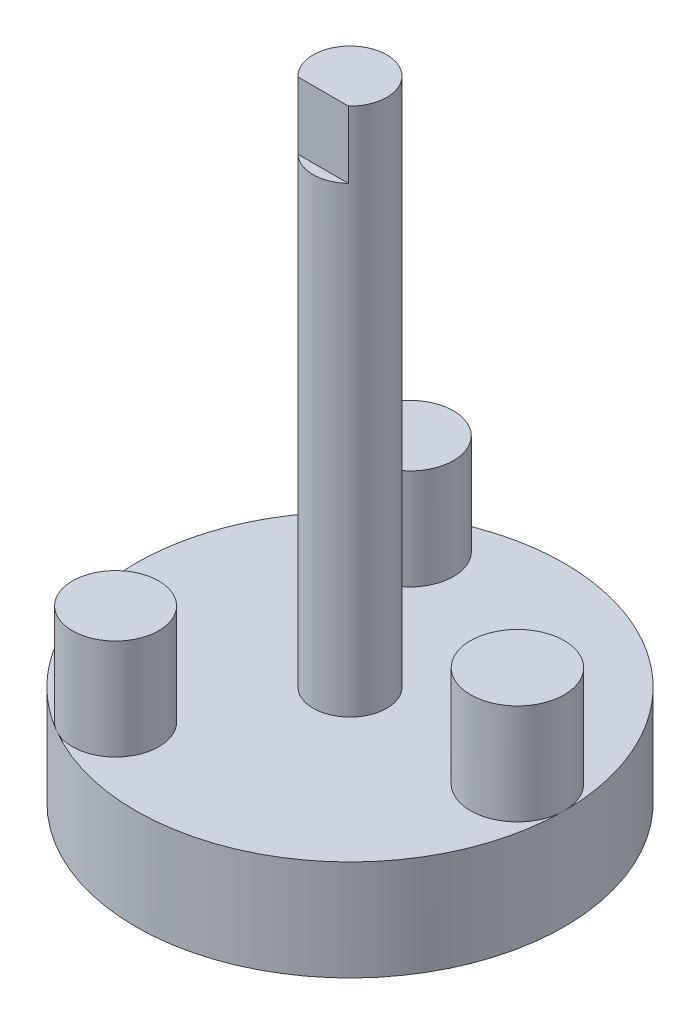
ISO-10303-21;
HEADER;
FILE_DESCRIPTION(('STEP AP214'),'2;1');
FILE_NAME('part.step','',(''),(''),'','','');
FILE_SCHEMA(('AUTOMOTIVE_DESIGN { 1 0 10303 214 1 1 1 1 }'));
ENDSEC;
DATA;
#1=APPLICATION_CONTEXT('core data for automotive mechanical design processes');
#2=APPLICATION_PROTOCOL_DEFINITION('international standard','automotive_design',2000,#1);
#3=PRODUCT_CONTEXT('',#1,'mechanical');
#4=PRODUCT('Part','Part','',(#3));
#5=PRODUCT_RELATED_PRODUCT_CATEGORY('part','',(#4));
#6=PRODUCT_DEFINITION_FORMATION('','',#4);
#7=PRODUCT_DEFINITION_CONTEXT('part definition',#1,'design');
#8=PRODUCT_DEFINITION('design','',#6,#7);
#9=PRODUCT_DEFINITION_SHAPE('','',#8);
#10=(LENGTH_UNIT() NAMED_UNIT(*) SI_UNIT(.MILLI.,.METRE.));
#11=(NAMED_UNIT(*) PLANE_ANGLE_UNIT() SI_UNIT($,.RADIAN.));
#12=(NAMED_UNIT(*) SI_UNIT($,.STERADIAN.) SOLID_ANGLE_UNIT());
#13=UNCERTAINTY_MEASURE_WITH_UNIT(LENGTH_MEASURE(1.E-05),#10,'distance_accuracy_value','');
#14=(GEOMETRIC_REPRESENTATION_CONTEXT(3) GLOBAL_UNCERTAINTY_ASSIGNED_CONTEXT((#13)) GLOBAL_UNIT_ASSIGNED_CONTEXT((#10,
#11,#12)) REPRESENTATION_CONTEXT('',''));
#15=CARTESIAN_POINT('',(0.,0.,0.));
#16=DIRECTION('',(0.,0.,1.));
#17=DIRECTION('',(1.,0.,0.));
#18=AXIS2_PLACEMENT_3D('',#15,#16,#17);
#19=CARTESIAN_POINT('',(0.,94.,0.));
#20=DIRECTION('',(0.,-1.,0.));
#21=DIRECTION('',(0.,0.,-1.));
#22=AXIS2_PLACEMENT_3D('',#19,#20,#21);
#23=CYLINDRICAL_SURFACE('',#22,5.5);
#24=CARTESIAN_POINT('',(0.,15.,0.));
#25=DIRECTION('',(0.,1.,0.));
#26=DIRECTION('',(0.,0.,1.));
#27=AXIS2_PLACEMENT_3D('',#24,#25,#26);
#28=CIRCLE('',#27,5.5);
#29=CARTESIAN_POINT('',(0.,15.,5.5));
#30=VERTEX_POINT('',#29);
#31=EDGE_CURVE('E93',#30,#30,#28,.T.);
#32=ORIENTED_EDGE('',*,*,#31,.T.);
#33=EDGE_LOOP('',(#32));
#34=FACE_BOUND('',#33,.T.);
#35=DIRECTION('',(0.,-1.,0.));
#36=VECTOR('',#35,1.);
#37=CARTESIAN_POINT('',(-3.77491721763537,94.,4.));
#38=LINE('',#37,#36);
#39=CARTESIAN_POINT('',(-3.77491721763537,94.,4.));
#40=VERTEX_POINT('',#39);
#41=CARTESIAN_POINT('',(-3.77491721763537,84.,4.));
#42=VERTEX_POINT('',#41);
#43=EDGE_CURVE('E87',#40,#42,#38,.T.);
#44=ORIENTED_EDGE('',*,*,#43,.F.);
#45=CARTESIAN_POINT('',(0.,94.,0.));
#46=DIRECTION('',(0.,1.,0.));
#47=DIRECTION('',(0.,0.,1.));
#48=AXIS2_PLACEMENT_3D('',#45,#46,#47);
#49=CIRCLE('',#48,5.5);
#50=CARTESIAN_POINT('',(3.77491721763537,94.,4.));
#51=VERTEX_POINT('',#50);
#52=EDGE_CURVE('E91',#51,#40,#49,.T.);
#53=ORIENTED_EDGE('',*,*,#52,.F.);
#54=DIRECTION('',(0.,-1.,0.));
#55=VECTOR('',#54,1.);
#56=CARTESIAN_POINT('',(3.77491721763537,94.,4.));
#57=LINE('',#56,#55);
#58=CARTESIAN_POINT('',(3.77491721763537,84.,4.));
#59=VERTEX_POINT('',#58);
#60=EDGE_CURVE('E60',#59,#51,#57,.F.);
#61=ORIENTED_EDGE('',*,*,#60,.F.);
#62=CARTESIAN_POINT('',(0.,84.,0.));
#63=DIRECTION('',(0.,1.,0.));
#64=DIRECTION('',(0.,0.,1.));
#65=AXIS2_PLACEMENT_3D('',#62,#63,#64);
#66=CIRCLE('',#65,5.5);
#67=EDGE_CURVE('E13',#42,#59,#66,.T.);
#68=ORIENTED_EDGE('',*,*,#67,.F.);
#69=EDGE_LOOP('',(#44,#53,#61,#68));
#70=FACE_BOUND('',#69,.T.);
#71=ADVANCED_FACE('F45',(#34,#70),#23,.T.);
#72=CARTESIAN_POINT('',(0.,94.,0.));
#73=DIRECTION('',(0.,1.,0.));
#74=DIRECTION('',(0.,0.,1.));
#75=AXIS2_PLACEMENT_3D('',#72,#73,#74);
#76=PLANE('',#75);
#77=ORIENTED_EDGE('',*,*,#52,.T.);
#78=DIRECTION('',(1.,0.,0.));
#79=VECTOR('',#78,1.);
#80=CARTESIAN_POINT('',(0.,94.,4.));
#81=LINE('',#80,#79);
#82=EDGE_CURVE('E53',#40,#51,#81,.T.);
#83=ORIENTED_EDGE('',*,*,#82,.T.);
#84=EDGE_LOOP('',(#77,#83));
#85=FACE_BOUND('',#84,.T.);
#86=ADVANCED_FACE('F122',(#85),#76,.T.);
#87=CARTESIAN_POINT('',(0.,15.,0.));
#88=DIRECTION('',(0.,-1.,0.));
#89=DIRECTION('',(0.,0.,-1.));
#90=AXIS2_PLACEMENT_3D('',#87,#88,#89);
#91=CYLINDRICAL_SURFACE('',#90,32.);
#92=CARTESIAN_POINT('',(0.,15.,0.));
#93=DIRECTION('',(0.,1.,0.));
#94=DIRECTION('',(0.,0.,1.));
#95=AXIS2_PLACEMENT_3D('',#92,#93,#94);
#96=CIRCLE('',#95,32.);
#97=CARTESIAN_POINT('',(32.,15.,0.));
#98=VERTEX_POINT('',#97);
#99=CARTESIAN_POINT('',(-16.2793379880525,15.,-27.5496489028581));
#100=VERTEX_POINT('',#99);
#101=EDGE_CURVE('E115',#98,#100,#96,.T.);
#102=ORIENTED_EDGE('',*,*,#101,.F.);
#103=CARTESIAN_POINT('',(-16.2793379880525,15.,27.5496489028581));
#104=VERTEX_POINT('',#103);
#105=EDGE_CURVE('E119',#104,#98,#96,.T.);
#106=ORIENTED_EDGE('',*,*,#105,.F.);
#107=EDGE_CURVE('E118',#100,#104,#96,.T.);
#108=ORIENTED_EDGE('',*,*,#107,.F.);
#109=EDGE_LOOP('',(#102,#106,#108));
#110=FACE_BOUND('',#109,.T.);
#111=CARTESIAN_POINT('',(0.,0.,0.));
#112=DIRECTION('',(0.,1.,0.));
#113=DIRECTION('',(0.,0.,1.));
#114=AXIS2_PLACEMENT_3D('',#111,#112,#113);
#115=CIRCLE('',#114,32.);
#116=CARTESIAN_POINT('',(0.,0.,32.));
#117=VERTEX_POINT('',#116);
#118=EDGE_CURVE('E112',#117,#117,#115,.T.);
#119=ORIENTED_EDGE('',*,*,#118,.T.);
#120=EDGE_LOOP('',(#119));
#121=FACE_BOUND('',#120,.T.);
#122=ADVANCED_FACE('F47',(#110,#121),#91,.T.);
#123=CARTESIAN_POINT('',(0.,15.,0.));
#124=DIRECTION('',(0.,1.,0.));
#125=DIRECTION('',(0.,0.,1.));
#126=AXIS2_PLACEMENT_3D('',#123,#124,#125);
#127=PLANE('',#126);
#128=ORIENTED_EDGE('',*,*,#31,.F.);
#129=EDGE_LOOP('',(#128));
#130=FACE_BOUND('',#129,.T.);
#131=ORIENTED_EDGE('',*,*,#107,.T.);
#132=CARTESIAN_POINT('',(-13.,15.,22.));
#133=DIRECTION('',(0.,1.,0.));
#134=DIRECTION('',(0.,0.,1.));
#135=AXIS2_PLACEMENT_3D('',#132,#133,#134);
#136=CIRCLE('',#135,6.44613532163872);
#137=EDGE_CURVE('E66',#104,#104,#136,.T.);
#138=ORIENTED_EDGE('',*,*,#137,.F.);
#139=ORIENTED_EDGE('',*,*,#105,.T.);
#140=CARTESIAN_POINT('',(25.,15.,0.));
#141=DIRECTION('',(0.,1.,0.));
#142=DIRECTION('',(0.,0.,1.));
#143=AXIS2_PLACEMENT_3D('',#140,#141,#142);
#144=CIRCLE('',#143,7.);
#145=EDGE_CURVE('E107',#98,#98,#144,.T.);
#146=ORIENTED_EDGE('',*,*,#145,.F.);
#147=ORIENTED_EDGE('',*,*,#101,.T.);
#148=CARTESIAN_POINT('',(-13.,15.,-22.));
#149=DIRECTION('',(0.,1.,0.));
#150=DIRECTION('',(0.,0.,1.));
#151=AXIS2_PLACEMENT_3D('',#148,#149,#150);
#152=CIRCLE('',#151,6.44613532163873);
#153=EDGE_CURVE('E102',#100,#100,#152,.T.);
#154=ORIENTED_EDGE('',*,*,#153,.F.);
#155=EDGE_LOOP('',(#131,#138,#139,#146,#147,#154));
#156=FACE_BOUND('',#155,.T.);
#157=ADVANCED_FACE('F129',(#130,#156),#127,.T.);
#158=CARTESIAN_POINT('',(0.,0.,0.));
#159=DIRECTION('',(0.,1.,0.));
#160=DIRECTION('',(0.,0.,1.));
#161=AXIS2_PLACEMENT_3D('',#158,#159,#160);
#162=PLANE('',#161);
#163=ORIENTED_EDGE('',*,*,#118,.F.);
#164=EDGE_LOOP('',(#163));
#165=FACE_BOUND('',#164,.T.);
#166=ADVANCED_FACE('F159',(#165),#162,.F.);
#167=CARTESIAN_POINT('',(25.,30.,0.));
#168=DIRECTION('',(0.,-1.,0.));
#169=DIRECTION('',(0.,0.,-1.));
#170=AXIS2_PLACEMENT_3D('',#167,#168,#169);
#171=CYLINDRICAL_SURFACE('',#170,7.);
#172=CARTESIAN_POINT('',(25.,30.,0.));
#173=DIRECTION('',(0.,1.,0.));
#174=DIRECTION('',(0.,0.,1.));
#175=AXIS2_PLACEMENT_3D('',#172,#173,#174);
#176=CIRCLE('',#175,7.);
#177=CARTESIAN_POINT('',(25.,30.,7.));
#178=VERTEX_POINT('',#177);
#179=EDGE_CURVE('E109',#178,#178,#176,.T.);
#180=ORIENTED_EDGE('',*,*,#179,.F.);
#181=EDGE_LOOP('',(#180));
#182=FACE_BOUND('',#181,.T.);
#183=ORIENTED_EDGE('',*,*,#145,.T.);
#184=EDGE_LOOP('',(#183));
#185=FACE_BOUND('',#184,.T.);
#186=ADVANCED_FACE('F155',(#182,#185),#171,.T.);
#187=CARTESIAN_POINT('',(25.,30.,0.));
#188=DIRECTION('',(0.,1.,0.));
#189=DIRECTION('',(0.,0.,1.));
#190=AXIS2_PLACEMENT_3D('',#187,#188,#189);
#191=PLANE('',#190);
#192=ORIENTED_EDGE('',*,*,#179,.T.);
#193=EDGE_LOOP('',(#192));
#194=FACE_BOUND('',#193,.T.);
#195=ADVANCED_FACE('F151',(#194),#191,.T.);
#196=CARTESIAN_POINT('',(-13.,30.,-22.));
#197=DIRECTION('',(0.,-1.,0.));
#198=DIRECTION('',(0.,0.,-1.));
#199=AXIS2_PLACEMENT_3D('',#196,#197,#198);
#200=CYLINDRICAL_SURFACE('',#199,6.44613532163873);
#201=CARTESIAN_POINT('',(-13.,30.,-22.));
#202=DIRECTION('',(0.,1.,0.));
#203=DIRECTION('',(0.,0.,1.));
#204=AXIS2_PLACEMENT_3D('',#201,#202,#203);
#205=CIRCLE('',#204,6.44613532163873);
#206=CARTESIAN_POINT('',(-13.,30.,-15.5538646783613));
#207=VERTEX_POINT('',#206);
#208=EDGE_CURVE('E104',#207,#207,#205,.T.);
#209=ORIENTED_EDGE('',*,*,#208,.F.);
#210=EDGE_LOOP('',(#209));
#211=FACE_BOUND('',#210,.T.);
#212=ORIENTED_EDGE('',*,*,#153,.T.);
#213=EDGE_LOOP('',(#212));
#214=FACE_BOUND('',#213,.T.);
#215=ADVANCED_FACE('F147',(#211,#214),#200,.T.);
#216=CARTESIAN_POINT('',(-13.,30.,-22.));
#217=DIRECTION('',(0.,1.,0.));
#218=DIRECTION('',(0.,0.,1.));
#219=AXIS2_PLACEMENT_3D('',#216,#217,#218);
#220=PLANE('',#219);
#221=ORIENTED_EDGE('',*,*,#208,.T.);
#222=EDGE_LOOP('',(#221));
#223=FACE_BOUND('',#222,.T.);
#224=ADVANCED_FACE('F143',(#223),#220,.T.);
#225=CARTESIAN_POINT('',(-13.,30.,22.));
#226=DIRECTION('',(0.,-1.,0.));
#227=DIRECTION('',(0.,0.,-1.));
#228=AXIS2_PLACEMENT_3D('',#225,#226,#227);
#229=CYLINDRICAL_SURFACE('',#228,6.44613532163872);
#230=CARTESIAN_POINT('',(-13.,30.,22.));
#231=DIRECTION('',(0.,1.,0.));
#232=DIRECTION('',(0.,0.,1.));
#233=AXIS2_PLACEMENT_3D('',#230,#231,#232);
#234=CIRCLE('',#233,6.44613532163872);
#235=CARTESIAN_POINT('',(-13.,30.,28.4461353216387));
#236=VERTEX_POINT('',#235);
#237=EDGE_CURVE('E99',#236,#236,#234,.T.);
#238=ORIENTED_EDGE('',*,*,#237,.F.);
#239=EDGE_LOOP('',(#238));
#240=FACE_BOUND('',#239,.T.);
#241=ORIENTED_EDGE('',*,*,#137,.T.);
#242=EDGE_LOOP('',(#241));
#243=FACE_BOUND('',#242,.T.);
#244=ADVANCED_FACE('F139',(#240,#243),#229,.T.);
#245=CARTESIAN_POINT('',(-13.,30.,22.));
#246=DIRECTION('',(0.,1.,0.));
#247=DIRECTION('',(0.,0.,1.));
#248=AXIS2_PLACEMENT_3D('',#245,#246,#247);
#249=PLANE('',#248);
#250=ORIENTED_EDGE('',*,*,#237,.T.);
#251=EDGE_LOOP('',(#250));
#252=FACE_BOUND('',#251,.T.);
#253=ADVANCED_FACE('F136',(#252),#249,.T.);
#254=CARTESIAN_POINT('',(79.,84.,4.));
#255=DIRECTION('',(0.,1.,0.));
#256=DIRECTION('',(0.,0.,1.));
#257=AXIS2_PLACEMENT_3D('',#254,#255,#256);
#258=PLANE('',#257);
#259=ORIENTED_EDGE('',*,*,#67,.T.);
#260=DIRECTION('',(-1.,0.,0.));
#261=VECTOR('',#260,1.);
#262=CARTESIAN_POINT('',(79.,84.,4.));
#263=LINE('',#262,#261);
#264=EDGE_CURVE('E83',#59,#42,#263,.T.);
#265=ORIENTED_EDGE('',*,*,#264,.T.);
#266=EDGE_LOOP('',(#259,#265));
#267=FACE_BOUND('',#266,.T.);
#268=ADVANCED_FACE('F82',(#267),#258,.T.);
#269=CARTESIAN_POINT('',(79.,94.,4.));
#270=DIRECTION('',(0.,0.,1.));
#271=DIRECTION('',(1.,0.,0.));
#272=AXIS2_PLACEMENT_3D('',#269,#270,#271);
#273=PLANE('',#272);
#274=ORIENTED_EDGE('',*,*,#43,.T.);
#275=ORIENTED_EDGE('',*,*,#264,.F.);
#276=ORIENTED_EDGE('',*,*,#60,.T.);
#277=ORIENTED_EDGE('',*,*,#82,.F.);
#278=EDGE_LOOP('',(#274,#275,#276,#277));
#279=FACE_BOUND('',#278,.T.);
#280=ADVANCED_FACE('F86',(#279),#273,.T.);
#281=CLOSED_SHELL('',(#71,#86,#122,#157,#166,#186,#195,#215,#224,#244,#253,#268,#280));
#282=MANIFOLD_SOLID_BREP('B2',#281);
#283=ADVANCED_BREP_SHAPE_REPRESENTATION('',(#18,#282),#14);
#284=SHAPE_DEFINITION_REPRESENTATION(#9,#283);
ENDSEC;
END-ISO-10303-21;
